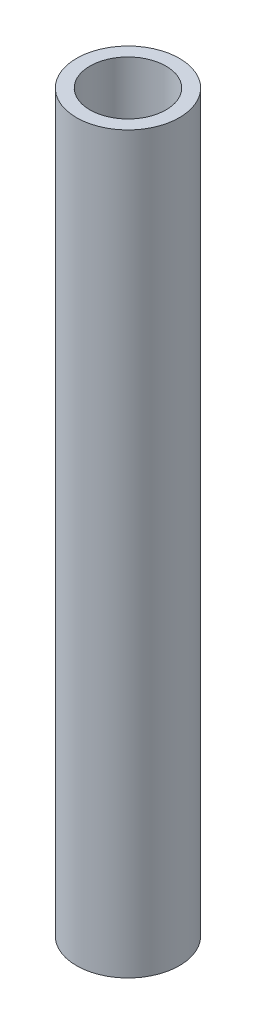
ISO-10303-21;
HEADER;
FILE_DESCRIPTION(('STEP AP214'),'2;1');
FILE_NAME('part.step','',(''),(''),'','','');
FILE_SCHEMA(('AUTOMOTIVE_DESIGN { 1 0 10303 214 1 1 1 1 }'));
ENDSEC;
DATA;
#1=APPLICATION_CONTEXT('core data for automotive mechanical design processes');
#2=APPLICATION_PROTOCOL_DEFINITION('international standard','automotive_design',2000,#1);
#3=PRODUCT_CONTEXT('',#1,'mechanical');
#4=PRODUCT('Part','Part','',(#3));
#5=PRODUCT_RELATED_PRODUCT_CATEGORY('part','',(#4));
#6=PRODUCT_DEFINITION_FORMATION('','',#4);
#7=PRODUCT_DEFINITION_CONTEXT('part definition',#1,'design');
#8=PRODUCT_DEFINITION('design','',#6,#7);
#9=PRODUCT_DEFINITION_SHAPE('','',#8);
#10=(LENGTH_UNIT() NAMED_UNIT(*) SI_UNIT(.MILLI.,.METRE.));
#11=(NAMED_UNIT(*) PLANE_ANGLE_UNIT() SI_UNIT($,.RADIAN.));
#12=(NAMED_UNIT(*) SI_UNIT($,.STERADIAN.) SOLID_ANGLE_UNIT());
#13=UNCERTAINTY_MEASURE_WITH_UNIT(LENGTH_MEASURE(1.E-05),#10,'distance_accuracy_value','');
#14=(GEOMETRIC_REPRESENTATION_CONTEXT(3) GLOBAL_UNCERTAINTY_ASSIGNED_CONTEXT((#13)) GLOBAL_UNIT_ASSIGNED_CONTEXT((#10,
#11,#12)) REPRESENTATION_CONTEXT('',''));
#15=CARTESIAN_POINT('',(0.,0.,0.));
#16=DIRECTION('',(0.,0.,1.));
#17=DIRECTION('',(1.,0.,0.));
#18=AXIS2_PLACEMENT_3D('',#15,#16,#17);
#19=CARTESIAN_POINT('',(0.,272.1102,0.));
#20=DIRECTION('',(0.,-1.,0.));
#21=DIRECTION('',(0.,0.,-1.));
#22=AXIS2_PLACEMENT_3D('',#19,#20,#21);
#23=CYLINDRICAL_SURFACE('',#22,19.05);
#24=CARTESIAN_POINT('',(0.,272.1102,0.));
#25=DIRECTION('',(0.,1.,0.));
#26=DIRECTION('',(0.,0.,1.));
#27=AXIS2_PLACEMENT_3D('',#24,#25,#26);
#28=CIRCLE('',#27,19.05);
#29=CARTESIAN_POINT('',(0.,272.1102,19.05));
#30=VERTEX_POINT('',#29);
#31=EDGE_CURVE('E10',#30,#30,#28,.T.);
#32=ORIENTED_EDGE('',*,*,#31,.F.);
#33=EDGE_LOOP('',(#32));
#34=FACE_BOUND('',#33,.T.);
#35=CARTESIAN_POINT('',(0.,0.,0.));
#36=DIRECTION('',(0.,1.,0.));
#37=DIRECTION('',(0.,0.,1.));
#38=AXIS2_PLACEMENT_3D('',#35,#36,#37);
#39=CIRCLE('',#38,19.05);
#40=CARTESIAN_POINT('',(0.,0.,19.05));
#41=VERTEX_POINT('',#40);
#42=EDGE_CURVE('E41',#41,#41,#39,.T.);
#43=ORIENTED_EDGE('',*,*,#42,.T.);
#44=EDGE_LOOP('',(#43));
#45=FACE_BOUND('',#44,.T.);
#46=ADVANCED_FACE('F34',(#34,#45),#23,.T.);
#47=CARTESIAN_POINT('',(0.,272.1102,0.));
#48=DIRECTION('',(0.,1.,0.));
#49=DIRECTION('',(0.,0.,1.));
#50=AXIS2_PLACEMENT_3D('',#47,#48,#49);
#51=PLANE('',#50);
#52=CARTESIAN_POINT('',(0.,272.1102,0.));
#53=DIRECTION('',(0.,1.,0.));
#54=DIRECTION('',(0.,0.,1.));
#55=AXIS2_PLACEMENT_3D('',#52,#53,#54);
#56=CIRCLE('',#55,14.08938);
#57=CARTESIAN_POINT('',(0.,272.1102,14.08938));
#58=VERTEX_POINT('',#57);
#59=EDGE_CURVE('E55',#58,#58,#56,.T.);
#60=ORIENTED_EDGE('',*,*,#59,.F.);
#61=EDGE_LOOP('',(#60));
#62=FACE_BOUND('',#61,.T.);
#63=ORIENTED_EDGE('',*,*,#31,.T.);
#64=EDGE_LOOP('',(#63));
#65=FACE_BOUND('',#64,.T.);
#66=ADVANCED_FACE('F76',(#62,#65),#51,.T.);
#67=CARTESIAN_POINT('',(0.,0.,0.));
#68=DIRECTION('',(0.,1.,0.));
#69=DIRECTION('',(0.,0.,1.));
#70=AXIS2_PLACEMENT_3D('',#67,#68,#69);
#71=PLANE('',#70);
#72=CARTESIAN_POINT('',(0.,0.,0.));
#73=DIRECTION('',(0.,-1.,0.));
#74=DIRECTION('',(0.,0.,-1.));
#75=AXIS2_PLACEMENT_3D('',#72,#73,#74);
#76=CIRCLE('',#75,14.08938);
#77=CARTESIAN_POINT('',(0.,0.,-14.08938));
#78=VERTEX_POINT('',#77);
#79=EDGE_CURVE('E66',#78,#78,#76,.T.);
#80=ORIENTED_EDGE('',*,*,#79,.F.);
#81=EDGE_LOOP('',(#80));
#82=FACE_BOUND('',#81,.T.);
#83=ORIENTED_EDGE('',*,*,#42,.F.);
#84=EDGE_LOOP('',(#83));
#85=FACE_BOUND('',#84,.T.);
#86=ADVANCED_FACE('F72',(#82,#85),#71,.F.);
#87=CARTESIAN_POINT('',(0.,0.,0.));
#88=DIRECTION('',(0.,1.,0.));
#89=DIRECTION('',(0.,0.,1.));
#90=AXIS2_PLACEMENT_3D('',#87,#88,#89);
#91=CYLINDRICAL_SURFACE('',#90,12.7);
#92=CARTESIAN_POINT('',(0.,49.8568237268645,0.));
#93=DIRECTION('',(0.,-1.,0.));
#94=DIRECTION('',(0.,0.,-1.));
#95=AXIS2_PLACEMENT_3D('',#92,#93,#94);
#96=CIRCLE('',#95,12.7);
#97=CARTESIAN_POINT('',(0.,49.8568237268645,-12.7));
#98=VERTEX_POINT('',#97);
#99=EDGE_CURVE('E37',#98,#98,#96,.T.);
#100=ORIENTED_EDGE('',*,*,#99,.T.);
#101=EDGE_LOOP('',(#100));
#102=FACE_BOUND('',#101,.T.);
#103=CARTESIAN_POINT('',(0.,222.253376273135,0.));
#104=DIRECTION('',(0.,1.,0.));
#105=DIRECTION('',(0.,0.,1.));
#106=AXIS2_PLACEMENT_3D('',#103,#104,#105);
#107=CIRCLE('',#106,12.7);
#108=CARTESIAN_POINT('',(0.,222.253376273135,12.7));
#109=VERTEX_POINT('',#108);
#110=EDGE_CURVE('E46',#109,#109,#107,.T.);
#111=ORIENTED_EDGE('',*,*,#110,.T.);
#112=EDGE_LOOP('',(#111));
#113=FACE_BOUND('',#112,.T.);
#114=ADVANCED_FACE('F75',(#102,#113),#91,.F.);
#115=CARTESIAN_POINT('',(0.,223.0882,0.));
#116=DIRECTION('',(0.,1.,0.));
#117=DIRECTION('',(0.,0.,1.));
#118=AXIS2_PLACEMENT_3D('',#115,#116,#117);
#119=CONICAL_SURFACE('',#118,14.08938,1.02974425867665);
#120=CARTESIAN_POINT('',(0.,223.0882,0.));
#121=DIRECTION('',(0.,1.,0.));
#122=DIRECTION('',(0.,0.,1.));
#123=AXIS2_PLACEMENT_3D('',#120,#121,#122);
#124=CIRCLE('',#123,14.08938);
#125=CARTESIAN_POINT('',(0.,223.0882,14.08938));
#126=VERTEX_POINT('',#125);
#127=EDGE_CURVE('E49',#126,#126,#124,.T.);
#128=ORIENTED_EDGE('',*,*,#127,.T.);
#129=EDGE_LOOP('',(#128));
#130=FACE_BOUND('',#129,.T.);
#131=ORIENTED_EDGE('',*,*,#110,.F.);
#132=EDGE_LOOP('',(#131));
#133=FACE_BOUND('',#132,.T.);
#134=ADVANCED_FACE('F91',(#130,#133),#119,.F.);
#135=CARTESIAN_POINT('',(0.,272.1102,0.));
#136=DIRECTION('',(0.,1.,0.));
#137=DIRECTION('',(0.,0.,1.));
#138=AXIS2_PLACEMENT_3D('',#135,#136,#137);
#139=CYLINDRICAL_SURFACE('',#138,14.08938);
#140=ORIENTED_EDGE('',*,*,#127,.F.);
#141=EDGE_LOOP('',(#140));
#142=FACE_BOUND('',#141,.T.);
#143=ORIENTED_EDGE('',*,*,#59,.T.);
#144=EDGE_LOOP('',(#143));
#145=FACE_BOUND('',#144,.T.);
#146=ADVANCED_FACE('F95',(#142,#145),#139,.F.);
#147=CARTESIAN_POINT('',(0.,49.022,0.));
#148=DIRECTION('',(0.,-1.,0.));
#149=DIRECTION('',(0.,0.,-1.));
#150=AXIS2_PLACEMENT_3D('',#147,#148,#149);
#151=CONICAL_SURFACE('',#150,14.08938,1.02974425867665);
#152=CARTESIAN_POINT('',(0.,49.022,0.));
#153=DIRECTION('',(0.,-1.,0.));
#154=DIRECTION('',(0.,0.,-1.));
#155=AXIS2_PLACEMENT_3D('',#152,#153,#154);
#156=CIRCLE('',#155,14.08938);
#157=CARTESIAN_POINT('',(0.,49.022,-14.08938));
#158=VERTEX_POINT('',#157);
#159=EDGE_CURVE('E62',#158,#158,#156,.T.);
#160=ORIENTED_EDGE('',*,*,#159,.T.);
#161=EDGE_LOOP('',(#160));
#162=FACE_BOUND('',#161,.T.);
#163=ORIENTED_EDGE('',*,*,#99,.F.);
#164=EDGE_LOOP('',(#163));
#165=FACE_BOUND('',#164,.T.);
#166=ADVANCED_FACE('F98',(#162,#165),#151,.F.);
#167=CARTESIAN_POINT('',(0.,0.,0.));
#168=DIRECTION('',(0.,-1.,0.));
#169=DIRECTION('',(0.,0.,-1.));
#170=AXIS2_PLACEMENT_3D('',#167,#168,#169);
#171=CYLINDRICAL_SURFACE('',#170,14.08938);
#172=ORIENTED_EDGE('',*,*,#159,.F.);
#173=EDGE_LOOP('',(#172));
#174=FACE_BOUND('',#173,.T.);
#175=ORIENTED_EDGE('',*,*,#79,.T.);
#176=EDGE_LOOP('',(#175));
#177=FACE_BOUND('',#176,.T.);
#178=ADVANCED_FACE('F70',(#174,#177),#171,.F.);
#179=CLOSED_SHELL('',(#46,#66,#86,#114,#134,#146,#166,#178));
#180=MANIFOLD_SOLID_BREP('B2',#179);
#181=ADVANCED_BREP_SHAPE_REPRESENTATION('',(#18,#180),#14);
#182=SHAPE_DEFINITION_REPRESENTATION(#9,#181);
ENDSEC;
END-ISO-10303-21;
